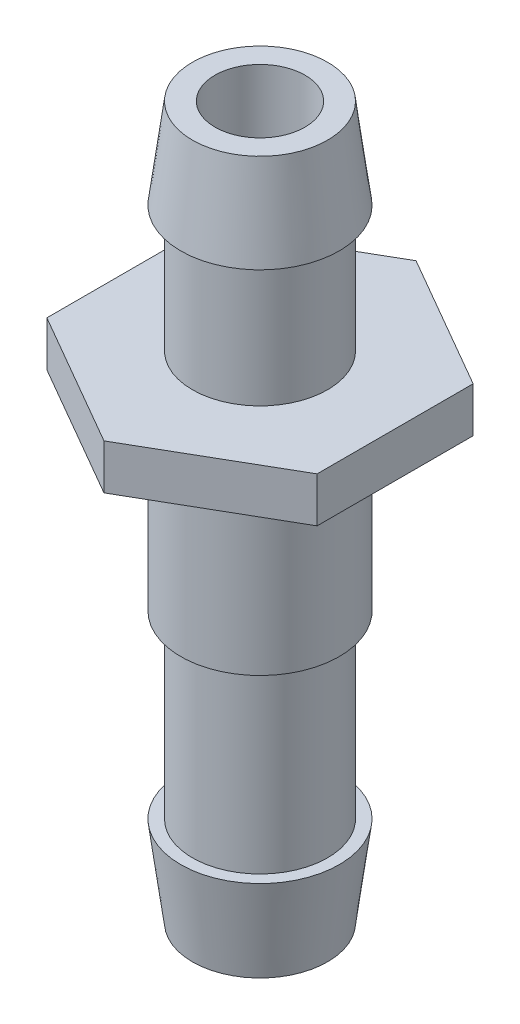
ISO-10303-21;
HEADER;
FILE_DESCRIPTION(('STEP AP214'),'2;1');
FILE_NAME('part.step','',(''),(''),'','','');
FILE_SCHEMA(('AUTOMOTIVE_DESIGN { 1 0 10303 214 1 1 1 1 }'));
ENDSEC;
DATA;
#1=APPLICATION_CONTEXT('core data for automotive mechanical design processes');
#2=APPLICATION_PROTOCOL_DEFINITION('international standard','automotive_design',2000,#1);
#3=PRODUCT_CONTEXT('',#1,'mechanical');
#4=PRODUCT('Part','Part','',(#3));
#5=PRODUCT_RELATED_PRODUCT_CATEGORY('part','',(#4));
#6=PRODUCT_DEFINITION_FORMATION('','',#4);
#7=PRODUCT_DEFINITION_CONTEXT('part definition',#1,'design');
#8=PRODUCT_DEFINITION('design','',#6,#7);
#9=PRODUCT_DEFINITION_SHAPE('','',#8);
#10=(LENGTH_UNIT() NAMED_UNIT(*) SI_UNIT(.MILLI.,.METRE.));
#11=(NAMED_UNIT(*) PLANE_ANGLE_UNIT() SI_UNIT($,.RADIAN.));
#12=(NAMED_UNIT(*) SI_UNIT($,.STERADIAN.) SOLID_ANGLE_UNIT());
#13=UNCERTAINTY_MEASURE_WITH_UNIT(LENGTH_MEASURE(1.E-05),#10,'distance_accuracy_value','');
#14=(GEOMETRIC_REPRESENTATION_CONTEXT(3) GLOBAL_UNCERTAINTY_ASSIGNED_CONTEXT((#13)) GLOBAL_UNIT_ASSIGNED_CONTEXT((#10,
#11,#12)) REPRESENTATION_CONTEXT('',''));
#15=CARTESIAN_POINT('',(0.,0.,0.));
#16=DIRECTION('',(0.,0.,1.));
#17=DIRECTION('',(1.,0.,0.));
#18=AXIS2_PLACEMENT_3D('',#15,#16,#17);
#19=CARTESIAN_POINT('',(0.,-34.925,0.));
#20=DIRECTION('',(0.,1.,0.));
#21=DIRECTION('',(0.,0.,1.));
#22=AXIS2_PLACEMENT_3D('',#19,#20,#21);
#23=CYLINDRICAL_SURFACE('',#22,4.7625);
#24=CARTESIAN_POINT('',(0.,-15.875,0.));
#25=DIRECTION('',(0.,-1.,0.));
#26=DIRECTION('',(0.,0.,-1.));
#27=AXIS2_PLACEMENT_3D('',#24,#25,#26);
#28=CIRCLE('',#27,4.7625);
#29=CARTESIAN_POINT('',(0.,-15.875,-4.7625));
#30=VERTEX_POINT('',#29);
#31=EDGE_CURVE('E258',#30,#30,#28,.T.);
#32=ORIENTED_EDGE('',*,*,#31,.T.);
#33=EDGE_LOOP('',(#32));
#34=FACE_BOUND('',#33,.T.);
#35=CARTESIAN_POINT('',(0.,-28.575,0.));
#36=DIRECTION('',(0.,-1.,0.));
#37=DIRECTION('',(0.,0.,-1.));
#38=AXIS2_PLACEMENT_3D('',#35,#36,#37);
#39=CIRCLE('',#38,4.7625);
#40=CARTESIAN_POINT('',(0.,-28.575,-4.7625));
#41=VERTEX_POINT('',#40);
#42=EDGE_CURVE('E11',#41,#41,#39,.T.);
#43=ORIENTED_EDGE('',*,*,#42,.F.);
#44=EDGE_LOOP('',(#43));
#45=FACE_BOUND('',#44,.T.);
#46=ADVANCED_FACE('F38',(#34,#45),#23,.T.);
#47=CARTESIAN_POINT('',(0.,15.24,0.));
#48=DIRECTION('',(0.,-1.,0.));
#49=DIRECTION('',(0.,0.,-1.));
#50=AXIS2_PLACEMENT_3D('',#47,#48,#49);
#51=CYLINDRICAL_SURFACE('',#50,4.7625);
#52=CARTESIAN_POINT('',(0.,0.,0.));
#53=DIRECTION('',(0.,1.,0.));
#54=DIRECTION('',(0.,0.,1.));
#55=AXIS2_PLACEMENT_3D('',#52,#53,#54);
#56=CIRCLE('',#55,4.7625);
#57=CARTESIAN_POINT('',(0.,0.,4.7625));
#58=VERTEX_POINT('',#57);
#59=EDGE_CURVE('E110',#58,#58,#56,.T.);
#60=ORIENTED_EDGE('',*,*,#59,.T.);
#61=EDGE_LOOP('',(#60));
#62=FACE_BOUND('',#61,.T.);
#63=CARTESIAN_POINT('',(0.,8.89,0.));
#64=DIRECTION('',(0.,1.,0.));
#65=DIRECTION('',(0.,0.,1.));
#66=AXIS2_PLACEMENT_3D('',#63,#64,#65);
#67=CIRCLE('',#66,4.7625);
#68=CARTESIAN_POINT('',(0.,8.89,4.7625));
#69=VERTEX_POINT('',#68);
#70=EDGE_CURVE('E46',#69,#69,#67,.T.);
#71=ORIENTED_EDGE('',*,*,#70,.F.);
#72=EDGE_LOOP('',(#71));
#73=FACE_BOUND('',#72,.T.);
#74=ADVANCED_FACE('F40',(#62,#73),#51,.T.);
#75=CARTESIAN_POINT('',(-19.05,-3.175,0.));
#76=DIRECTION('',(0.,1.,0.));
#77=DIRECTION('',(0.,0.,1.));
#78=AXIS2_PLACEMENT_3D('',#75,#76,#77);
#79=PLANE('',#78);
#80=CARTESIAN_POINT('',(0.,-3.175,0.));
#81=DIRECTION('',(0.,-1.,0.));
#82=DIRECTION('',(0.,0.,-1.));
#83=AXIS2_PLACEMENT_3D('',#80,#81,#82);
#84=CIRCLE('',#83,7.366);
#85=CARTESIAN_POINT('',(0.,-3.175,-7.366));
#86=VERTEX_POINT('',#85);
#87=EDGE_CURVE('E275',#86,#86,#84,.T.);
#88=ORIENTED_EDGE('',*,*,#87,.F.);
#89=EDGE_LOOP('',(#88));
#90=FACE_BOUND('',#89,.T.);
#91=DIRECTION('',(-0.866025403784439,0.,-0.5));
#92=VECTOR('',#91,1.);
#93=CARTESIAN_POINT('',(0.,-3.175,10.9985226280624));
#94=LINE('',#93,#92);
#95=CARTESIAN_POINT('',(0.,-3.175,10.9985226280624));
#96=VERTEX_POINT('',#95);
#97=CARTESIAN_POINT('',(-9.525,-3.175,5.49926131403119));
#98=VERTEX_POINT('',#97);
#99=EDGE_CURVE('E130',#96,#98,#94,.T.);
#100=ORIENTED_EDGE('',*,*,#99,.T.);
#101=DIRECTION('',(0.,0.,-1.));
#102=VECTOR('',#101,1.);
#103=CARTESIAN_POINT('',(-9.525,-3.175,5.49926131403119));
#104=LINE('',#103,#102);
#105=CARTESIAN_POINT('',(-9.525,-3.175,-5.49926131403118));
#106=VERTEX_POINT('',#105);
#107=EDGE_CURVE('E107',#98,#106,#104,.T.);
#108=ORIENTED_EDGE('',*,*,#107,.T.);
#109=DIRECTION('',(0.866025403784438,0.,-0.5));
#110=VECTOR('',#109,1.);
#111=CARTESIAN_POINT('',(0.,-3.175,-10.9985226280624));
#112=LINE('',#111,#110);
#113=CARTESIAN_POINT('',(0.,-3.175,-10.9985226280624));
#114=VERTEX_POINT('',#113);
#115=EDGE_CURVE('E133',#106,#114,#112,.T.);
#116=ORIENTED_EDGE('',*,*,#115,.T.);
#117=DIRECTION('',(0.866025403784438,0.,0.5));
#118=VECTOR('',#117,1.);
#119=CARTESIAN_POINT('',(0.,-3.175,-10.9985226280624));
#120=LINE('',#119,#118);
#121=CARTESIAN_POINT('',(9.525,-3.175,-5.49926131403118));
#122=VERTEX_POINT('',#121);
#123=EDGE_CURVE('E135',#114,#122,#120,.T.);
#124=ORIENTED_EDGE('',*,*,#123,.T.);
#125=DIRECTION('',(0.,0.,1.));
#126=VECTOR('',#125,1.);
#127=CARTESIAN_POINT('',(9.525,-3.175,5.49926131403119));
#128=LINE('',#127,#126);
#129=CARTESIAN_POINT('',(9.525,-3.175,5.49926131403119));
#130=VERTEX_POINT('',#129);
#131=EDGE_CURVE('E58',#122,#130,#128,.T.);
#132=ORIENTED_EDGE('',*,*,#131,.T.);
#133=DIRECTION('',(-0.866025403784439,0.,0.5));
#134=VECTOR('',#133,1.);
#135=CARTESIAN_POINT('',(0.,-3.175,10.9985226280624));
#136=LINE('',#135,#134);
#137=EDGE_CURVE('E53',#130,#96,#136,.T.);
#138=ORIENTED_EDGE('',*,*,#137,.T.);
#139=EDGE_LOOP('',(#100,#108,#116,#124,#132,#138));
#140=FACE_BOUND('',#139,.T.);
#141=ADVANCED_FACE('F161',(#90,#140),#79,.F.);
#142=CARTESIAN_POINT('',(0.,15.24,0.));
#143=DIRECTION('',(0.,1.,0.));
#144=DIRECTION('',(0.,0.,1.));
#145=AXIS2_PLACEMENT_3D('',#142,#143,#144);
#146=PLANE('',#145);
#147=CARTESIAN_POINT('',(0.,15.24,0.));
#148=DIRECTION('',(0.,1.,0.));
#149=DIRECTION('',(0.,0.,1.));
#150=AXIS2_PLACEMENT_3D('',#147,#148,#149);
#151=CIRCLE('',#150,4.7625);
#152=CARTESIAN_POINT('',(0.,15.24,4.7625));
#153=VERTEX_POINT('',#152);
#154=EDGE_CURVE('E210',#153,#153,#151,.T.);
#155=ORIENTED_EDGE('',*,*,#154,.T.);
#156=EDGE_LOOP('',(#155));
#157=FACE_BOUND('',#156,.T.);
#158=CARTESIAN_POINT('',(0.,15.24,0.));
#159=DIRECTION('',(0.,1.,0.));
#160=DIRECTION('',(0.,0.,1.));
#161=AXIS2_PLACEMENT_3D('',#158,#159,#160);
#162=CIRCLE('',#161,3.175);
#163=CARTESIAN_POINT('',(0.,15.24,3.175));
#164=VERTEX_POINT('',#163);
#165=EDGE_CURVE('E152',#164,#164,#162,.T.);
#166=ORIENTED_EDGE('',*,*,#165,.F.);
#167=EDGE_LOOP('',(#166));
#168=FACE_BOUND('',#167,.T.);
#169=ADVANCED_FACE('F167',(#157,#168),#146,.T.);
#170=CARTESIAN_POINT('',(0.,15.24,0.));
#171=DIRECTION('',(0.,-1.,0.));
#172=DIRECTION('',(0.,0.,-1.));
#173=AXIS2_PLACEMENT_3D('',#170,#171,#172);
#174=CYLINDRICAL_SURFACE('',#173,3.175);
#175=ORIENTED_EDGE('',*,*,#165,.T.);
#176=EDGE_LOOP('',(#175));
#177=FACE_BOUND('',#176,.T.);
#178=CARTESIAN_POINT('',(0.,-34.925,0.));
#179=DIRECTION('',(0.,-1.,0.));
#180=DIRECTION('',(0.,0.,-1.));
#181=AXIS2_PLACEMENT_3D('',#178,#179,#180);
#182=CIRCLE('',#181,3.175);
#183=CARTESIAN_POINT('',(0.,-34.925,-3.175));
#184=VERTEX_POINT('',#183);
#185=EDGE_CURVE('E116',#184,#184,#182,.T.);
#186=ORIENTED_EDGE('',*,*,#185,.T.);
#187=EDGE_LOOP('',(#186));
#188=FACE_BOUND('',#187,.T.);
#189=ADVANCED_FACE('F174',(#177,#188),#174,.F.);
#190=CARTESIAN_POINT('',(-19.05,0.,0.));
#191=DIRECTION('',(0.,1.,0.));
#192=DIRECTION('',(0.,0.,1.));
#193=AXIS2_PLACEMENT_3D('',#190,#191,#192);
#194=PLANE('',#193);
#195=DIRECTION('',(-0.866025403784439,0.,-0.5));
#196=VECTOR('',#195,1.);
#197=CARTESIAN_POINT('',(0.,0.,10.9985226280624));
#198=LINE('',#197,#196);
#199=CARTESIAN_POINT('',(0.,0.,10.9985226280624));
#200=VERTEX_POINT('',#199);
#201=CARTESIAN_POINT('',(-9.525,0.,5.49926131403119));
#202=VERTEX_POINT('',#201);
#203=EDGE_CURVE('E97',#200,#202,#198,.T.);
#204=ORIENTED_EDGE('',*,*,#203,.F.);
#205=DIRECTION('',(-0.866025403784439,0.,0.5));
#206=VECTOR('',#205,1.);
#207=CARTESIAN_POINT('',(0.,0.,10.9985226280624));
#208=LINE('',#207,#206);
#209=CARTESIAN_POINT('',(9.525,0.,5.49926131403119));
#210=VERTEX_POINT('',#209);
#211=EDGE_CURVE('E128',#210,#200,#208,.T.);
#212=ORIENTED_EDGE('',*,*,#211,.F.);
#213=DIRECTION('',(0.,0.,1.));
#214=VECTOR('',#213,1.);
#215=CARTESIAN_POINT('',(9.525,0.,5.49926131403119));
#216=LINE('',#215,#214);
#217=CARTESIAN_POINT('',(9.525,0.,-5.49926131403118));
#218=VERTEX_POINT('',#217);
#219=EDGE_CURVE('E126',#218,#210,#216,.T.);
#220=ORIENTED_EDGE('',*,*,#219,.F.);
#221=DIRECTION('',(0.866025403784438,0.,0.5));
#222=VECTOR('',#221,1.);
#223=CARTESIAN_POINT('',(0.,0.,-10.9985226280624));
#224=LINE('',#223,#222);
#225=CARTESIAN_POINT('',(0.,0.,-10.9985226280624));
#226=VERTEX_POINT('',#225);
#227=EDGE_CURVE('E124',#226,#218,#224,.T.);
#228=ORIENTED_EDGE('',*,*,#227,.F.);
#229=DIRECTION('',(0.866025403784438,0.,-0.5));
#230=VECTOR('',#229,1.);
#231=CARTESIAN_POINT('',(0.,0.,-10.9985226280624));
#232=LINE('',#231,#230);
#233=CARTESIAN_POINT('',(-9.525,0.,-5.49926131403118));
#234=VERTEX_POINT('',#233);
#235=EDGE_CURVE('E99',#234,#226,#232,.T.);
#236=ORIENTED_EDGE('',*,*,#235,.F.);
#237=DIRECTION('',(0.,0.,-1.));
#238=VECTOR('',#237,1.);
#239=CARTESIAN_POINT('',(-9.525,0.,5.49926131403119));
#240=LINE('',#239,#238);
#241=EDGE_CURVE('E91',#202,#234,#240,.T.);
#242=ORIENTED_EDGE('',*,*,#241,.F.);
#243=EDGE_LOOP('',(#204,#212,#220,#228,#236,#242));
#244=FACE_BOUND('',#243,.T.);
#245=ORIENTED_EDGE('',*,*,#59,.F.);
#246=EDGE_LOOP('',(#245));
#247=FACE_BOUND('',#246,.T.);
#248=ADVANCED_FACE('F93',(#244,#247),#194,.T.);
#249=CARTESIAN_POINT('',(0.,-3.175,10.9985226280624));
#250=DIRECTION('',(0.5,0.,-0.866025403784439));
#251=DIRECTION('',(-0.866025403784439,0.,-0.5));
#252=AXIS2_PLACEMENT_3D('',#249,#250,#251);
#253=PLANE('',#252);
#254=ORIENTED_EDGE('',*,*,#203,.T.);
#255=DIRECTION('',(0.,1.,0.));
#256=VECTOR('',#255,1.);
#257=CARTESIAN_POINT('',(-9.525,-3.175,5.49926131403119));
#258=LINE('',#257,#256);
#259=EDGE_CURVE('E105',#98,#202,#258,.T.);
#260=ORIENTED_EDGE('',*,*,#259,.F.);
#261=ORIENTED_EDGE('',*,*,#99,.F.);
#262=DIRECTION('',(0.,1.,0.));
#263=VECTOR('',#262,1.);
#264=CARTESIAN_POINT('',(0.,-3.175,10.9985226280624));
#265=LINE('',#264,#263);
#266=EDGE_CURVE('E115',#96,#200,#265,.T.);
#267=ORIENTED_EDGE('',*,*,#266,.T.);
#268=EDGE_LOOP('',(#254,#260,#261,#267));
#269=FACE_BOUND('',#268,.T.);
#270=ADVANCED_FACE('F114',(#269),#253,.F.);
#271=CARTESIAN_POINT('',(-9.525,-3.175,5.49926131403119));
#272=DIRECTION('',(1.,0.,0.));
#273=DIRECTION('',(0.,0.,-1.));
#274=AXIS2_PLACEMENT_3D('',#271,#272,#273);
#275=PLANE('',#274);
#276=ORIENTED_EDGE('',*,*,#241,.T.);
#277=DIRECTION('',(0.,1.,0.));
#278=VECTOR('',#277,1.);
#279=CARTESIAN_POINT('',(-9.525,-3.175,-5.49926131403118));
#280=LINE('',#279,#278);
#281=EDGE_CURVE('E111',#106,#234,#280,.T.);
#282=ORIENTED_EDGE('',*,*,#281,.F.);
#283=ORIENTED_EDGE('',*,*,#107,.F.);
#284=ORIENTED_EDGE('',*,*,#259,.T.);
#285=EDGE_LOOP('',(#276,#282,#283,#284));
#286=FACE_BOUND('',#285,.T.);
#287=ADVANCED_FACE('F106',(#286),#275,.F.);
#288=CARTESIAN_POINT('',(0.,-3.175,-10.9985226280624));
#289=DIRECTION('',(0.5,0.,0.866025403784438));
#290=DIRECTION('',(0.866025403784439,0.,-0.5));
#291=AXIS2_PLACEMENT_3D('',#288,#289,#290);
#292=PLANE('',#291);
#293=ORIENTED_EDGE('',*,*,#235,.T.);
#294=DIRECTION('',(0.,1.,0.));
#295=VECTOR('',#294,1.);
#296=CARTESIAN_POINT('',(0.,-3.175,-10.9985226280624));
#297=LINE('',#296,#295);
#298=EDGE_CURVE('E146',#114,#226,#297,.T.);
#299=ORIENTED_EDGE('',*,*,#298,.F.);
#300=ORIENTED_EDGE('',*,*,#115,.F.);
#301=ORIENTED_EDGE('',*,*,#281,.T.);
#302=EDGE_LOOP('',(#293,#299,#300,#301));
#303=FACE_BOUND('',#302,.T.);
#304=ADVANCED_FACE('F197',(#303),#292,.F.);
#305=CARTESIAN_POINT('',(0.,-3.175,-10.9985226280624));
#306=DIRECTION('',(-0.5,0.,0.866025403784438));
#307=DIRECTION('',(0.866025403784439,0.,0.5));
#308=AXIS2_PLACEMENT_3D('',#305,#306,#307);
#309=PLANE('',#308);
#310=ORIENTED_EDGE('',*,*,#227,.T.);
#311=DIRECTION('',(0.,1.,0.));
#312=VECTOR('',#311,1.);
#313=CARTESIAN_POINT('',(9.525,-3.175,-5.49926131403118));
#314=LINE('',#313,#312);
#315=EDGE_CURVE('E143',#122,#218,#314,.T.);
#316=ORIENTED_EDGE('',*,*,#315,.F.);
#317=ORIENTED_EDGE('',*,*,#123,.F.);
#318=ORIENTED_EDGE('',*,*,#298,.T.);
#319=EDGE_LOOP('',(#310,#316,#317,#318));
#320=FACE_BOUND('',#319,.T.);
#321=ADVANCED_FACE('F193',(#320),#309,.F.);
#322=CARTESIAN_POINT('',(9.525,-3.175,5.49926131403119));
#323=DIRECTION('',(-1.,0.,0.));
#324=DIRECTION('',(0.,0.,1.));
#325=AXIS2_PLACEMENT_3D('',#322,#323,#324);
#326=PLANE('',#325);
#327=ORIENTED_EDGE('',*,*,#219,.T.);
#328=DIRECTION('',(0.,1.,0.));
#329=VECTOR('',#328,1.);
#330=CARTESIAN_POINT('',(9.525,-3.175,5.49926131403119));
#331=LINE('',#330,#329);
#332=EDGE_CURVE('E140',#130,#210,#331,.T.);
#333=ORIENTED_EDGE('',*,*,#332,.F.);
#334=ORIENTED_EDGE('',*,*,#131,.F.);
#335=ORIENTED_EDGE('',*,*,#315,.T.);
#336=EDGE_LOOP('',(#327,#333,#334,#335));
#337=FACE_BOUND('',#336,.T.);
#338=ADVANCED_FACE('F189',(#337),#326,.F.);
#339=CARTESIAN_POINT('',(0.,-3.175,10.9985226280624));
#340=DIRECTION('',(-0.5,0.,-0.866025403784439));
#341=DIRECTION('',(-0.866025403784439,0.,0.5));
#342=AXIS2_PLACEMENT_3D('',#339,#340,#341);
#343=PLANE('',#342);
#344=ORIENTED_EDGE('',*,*,#211,.T.);
#345=ORIENTED_EDGE('',*,*,#266,.F.);
#346=ORIENTED_EDGE('',*,*,#137,.F.);
#347=ORIENTED_EDGE('',*,*,#332,.T.);
#348=EDGE_LOOP('',(#344,#345,#346,#347));
#349=FACE_BOUND('',#348,.T.);
#350=ADVANCED_FACE('F185',(#349),#343,.F.);
#351=CARTESIAN_POINT('',(0.,-34.925,0.));
#352=DIRECTION('',(0.,-1.,0.));
#353=DIRECTION('',(0.,0.,-1.));
#354=AXIS2_PLACEMENT_3D('',#351,#352,#353);
#355=PLANE('',#354);
#356=CARTESIAN_POINT('',(0.,-34.925,0.));
#357=DIRECTION('',(0.,1.,0.));
#358=DIRECTION('',(0.,0.,1.));
#359=AXIS2_PLACEMENT_3D('',#356,#357,#358);
#360=CIRCLE('',#359,4.76249999999999);
#361=CARTESIAN_POINT('',(0.,-34.925,4.76249999999999));
#362=VERTEX_POINT('',#361);
#363=EDGE_CURVE('E260',#362,#362,#360,.T.);
#364=ORIENTED_EDGE('',*,*,#363,.F.);
#365=EDGE_LOOP('',(#364));
#366=FACE_BOUND('',#365,.T.);
#367=ORIENTED_EDGE('',*,*,#185,.F.);
#368=EDGE_LOOP('',(#367));
#369=FACE_BOUND('',#368,.T.);
#370=ADVANCED_FACE('F188',(#366,#369),#355,.T.);
#371=CARTESIAN_POINT('',(0.,-1.5875,0.));
#372=DIRECTION('',(0.,-1.,0.));
#373=DIRECTION('',(0.,0.,-1.));
#374=AXIS2_PLACEMENT_3D('',#371,#372,#373);
#375=CYLINDRICAL_SURFACE('',#374,7.366);
#376=CARTESIAN_POINT('',(0.,-1.5875,0.));
#377=DIRECTION('',(0.,-1.,0.));
#378=DIRECTION('',(0.,0.,-1.));
#379=AXIS2_PLACEMENT_3D('',#376,#377,#378);
#380=CIRCLE('',#379,7.366);
#381=CARTESIAN_POINT('',(0.,-1.5875,-7.366));
#382=VERTEX_POINT('',#381);
#383=EDGE_CURVE('E119',#382,#382,#380,.T.);
#384=ORIENTED_EDGE('',*,*,#383,.F.);
#385=EDGE_LOOP('',(#384));
#386=FACE_BOUND('',#385,.T.);
#387=ORIENTED_EDGE('',*,*,#87,.T.);
#388=EDGE_LOOP('',(#387));
#389=FACE_BOUND('',#388,.T.);
#390=ADVANCED_FACE('F216',(#386,#389),#375,.F.);
#391=CARTESIAN_POINT('',(0.,-1.5875,0.));
#392=DIRECTION('',(0.,-1.,0.));
#393=DIRECTION('',(0.,0.,-1.));
#394=AXIS2_PLACEMENT_3D('',#391,#392,#393);
#395=PLANE('',#394);
#396=CARTESIAN_POINT('',(0.,-1.5875,0.));
#397=DIRECTION('',(0.,-1.,0.));
#398=DIRECTION('',(0.,0.,-1.));
#399=AXIS2_PLACEMENT_3D('',#396,#397,#398);
#400=CIRCLE('',#399,5.588);
#401=CARTESIAN_POINT('',(0.,-1.5875,-5.588));
#402=VERTEX_POINT('',#401);
#403=EDGE_CURVE('E272',#402,#402,#400,.T.);
#404=ORIENTED_EDGE('',*,*,#403,.F.);
#405=EDGE_LOOP('',(#404));
#406=FACE_BOUND('',#405,.T.);
#407=ORIENTED_EDGE('',*,*,#383,.T.);
#408=EDGE_LOOP('',(#407));
#409=FACE_BOUND('',#408,.T.);
#410=ADVANCED_FACE('F221',(#406,#409),#395,.T.);
#411=CARTESIAN_POINT('',(0.,-1.5875,0.));
#412=DIRECTION('',(0.,-1.,0.));
#413=DIRECTION('',(0.,0.,-1.));
#414=AXIS2_PLACEMENT_3D('',#411,#412,#413);
#415=CYLINDRICAL_SURFACE('',#414,5.588);
#416=ORIENTED_EDGE('',*,*,#403,.T.);
#417=EDGE_LOOP('',(#416));
#418=FACE_BOUND('',#417,.T.);
#419=CARTESIAN_POINT('',(0.,-15.875,0.));
#420=DIRECTION('',(0.,-1.,0.));
#421=DIRECTION('',(0.,0.,-1.));
#422=AXIS2_PLACEMENT_3D('',#419,#420,#421);
#423=CIRCLE('',#422,5.588);
#424=CARTESIAN_POINT('',(0.,-15.875,-5.588));
#425=VERTEX_POINT('',#424);
#426=EDGE_CURVE('E255',#425,#425,#423,.T.);
#427=ORIENTED_EDGE('',*,*,#426,.F.);
#428=EDGE_LOOP('',(#427));
#429=FACE_BOUND('',#428,.T.);
#430=ADVANCED_FACE('F228',(#418,#429),#415,.T.);
#431=CARTESIAN_POINT('',(0.,8.89,0.));
#432=DIRECTION('',(0.,1.,0.));
#433=DIRECTION('',(0.,0.,1.));
#434=AXIS2_PLACEMENT_3D('',#431,#432,#433);
#435=PLANE('',#434);
#436=ORIENTED_EDGE('',*,*,#70,.T.);
#437=EDGE_LOOP('',(#436));
#438=FACE_BOUND('',#437,.T.);
#439=CARTESIAN_POINT('',(0.,8.89,0.));
#440=DIRECTION('',(0.,1.,0.));
#441=DIRECTION('',(0.,0.,1.));
#442=AXIS2_PLACEMENT_3D('',#439,#440,#441);
#443=CIRCLE('',#442,5.588);
#444=CARTESIAN_POINT('',(0.,8.89,5.588));
#445=VERTEX_POINT('',#444);
#446=EDGE_CURVE('E268',#445,#445,#443,.T.);
#447=ORIENTED_EDGE('',*,*,#446,.F.);
#448=EDGE_LOOP('',(#447));
#449=FACE_BOUND('',#448,.T.);
#450=ADVANCED_FACE('F157',(#438,#449),#435,.F.);
#451=CARTESIAN_POINT('',(0.,-28.575,0.));
#452=DIRECTION('',(0.,-1.,0.));
#453=DIRECTION('',(0.,0.,-1.));
#454=AXIS2_PLACEMENT_3D('',#451,#452,#453);
#455=PLANE('',#454);
#456=ORIENTED_EDGE('',*,*,#42,.T.);
#457=EDGE_LOOP('',(#456));
#458=FACE_BOUND('',#457,.T.);
#459=CARTESIAN_POINT('',(0.,-28.575,0.));
#460=DIRECTION('',(0.,1.,0.));
#461=DIRECTION('',(0.,0.,1.));
#462=AXIS2_PLACEMENT_3D('',#459,#460,#461);
#463=CIRCLE('',#462,5.588);
#464=CARTESIAN_POINT('',(0.,-28.575,5.588));
#465=VERTEX_POINT('',#464);
#466=EDGE_CURVE('E265',#465,#465,#463,.T.);
#467=ORIENTED_EDGE('',*,*,#466,.T.);
#468=EDGE_LOOP('',(#467));
#469=FACE_BOUND('',#468,.T.);
#470=ADVANCED_FACE('F235',(#458,#469),#455,.F.);
#471=CARTESIAN_POINT('',(0.,8.89,0.));
#472=DIRECTION('',(0.,-1.,0.));
#473=DIRECTION('',(0.,0.,-1.));
#474=AXIS2_PLACEMENT_3D('',#471,#472,#473);
#475=CONICAL_SURFACE('',#474,5.588,0.129275004048143);
#476=ORIENTED_EDGE('',*,*,#154,.F.);
#477=EDGE_LOOP('',(#476));
#478=FACE_BOUND('',#477,.T.);
#479=ORIENTED_EDGE('',*,*,#446,.T.);
#480=EDGE_LOOP('',(#479));
#481=FACE_BOUND('',#480,.T.);
#482=ADVANCED_FACE('F238',(#478,#481),#475,.T.);
#483=CARTESIAN_POINT('',(0.,-34.925,0.));
#484=DIRECTION('',(0.,1.,0.));
#485=DIRECTION('',(0.,0.,1.));
#486=AXIS2_PLACEMENT_3D('',#483,#484,#485);
#487=CONICAL_SURFACE('',#486,4.76249999999999,0.129275004048143);
#488=ORIENTED_EDGE('',*,*,#466,.F.);
#489=EDGE_LOOP('',(#488));
#490=FACE_BOUND('',#489,.T.);
#491=ORIENTED_EDGE('',*,*,#363,.T.);
#492=EDGE_LOOP('',(#491));
#493=FACE_BOUND('',#492,.T.);
#494=ADVANCED_FACE('F242',(#490,#493),#487,.T.);
#495=CARTESIAN_POINT('',(0.,-15.875,0.));
#496=DIRECTION('',(0.,-1.,0.));
#497=DIRECTION('',(0.,0.,-1.));
#498=AXIS2_PLACEMENT_3D('',#495,#496,#497);
#499=PLANE('',#498);
#500=ORIENTED_EDGE('',*,*,#426,.T.);
#501=EDGE_LOOP('',(#500));
#502=FACE_BOUND('',#501,.T.);
#503=ORIENTED_EDGE('',*,*,#31,.F.);
#504=EDGE_LOOP('',(#503));
#505=FACE_BOUND('',#504,.T.);
#506=ADVANCED_FACE('F246',(#502,#505),#499,.T.);
#507=CLOSED_SHELL('',(#46,#74,#141,#169,#189,#248,#270,#287,#304,#321,#338,#350,#370,#390,#410,
#430,#450,#470,#482,#494,#506));
#508=MANIFOLD_SOLID_BREP('B2',#507);
#509=ADVANCED_BREP_SHAPE_REPRESENTATION('',(#18,#508),#14);
#510=SHAPE_DEFINITION_REPRESENTATION(#9,#509);
ENDSEC;
END-ISO-10303-21;
